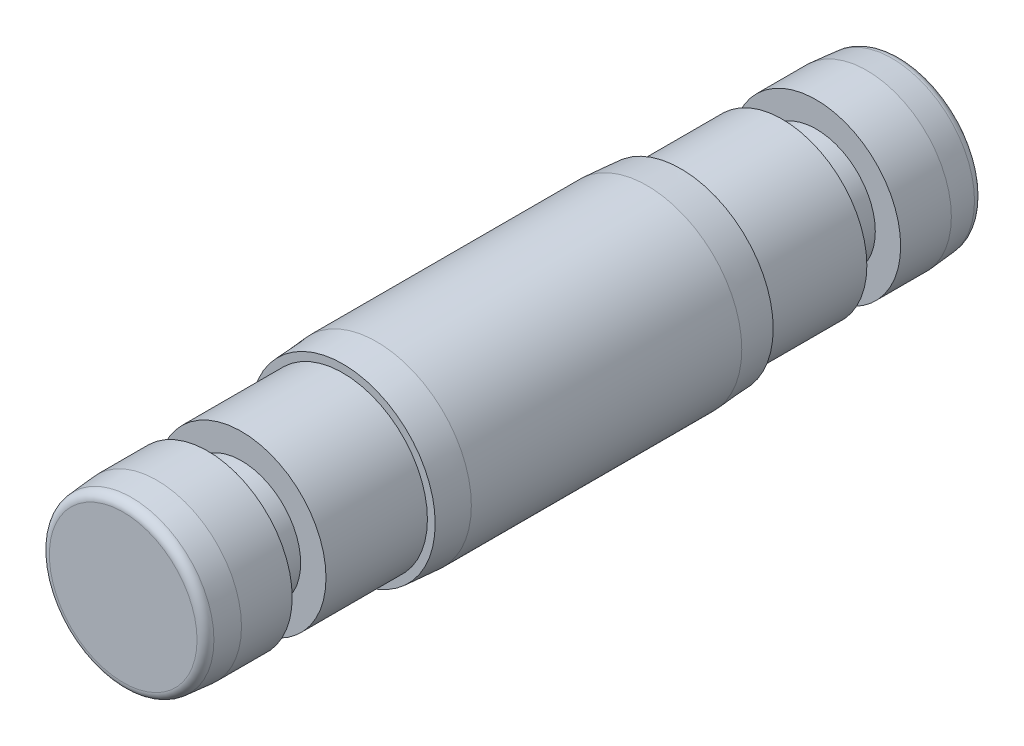
ISO-10303-21;
HEADER;
FILE_DESCRIPTION(('STEP AP214'),'2;1');
FILE_NAME('part.step','',(''),(''),'','','');
FILE_SCHEMA(('AUTOMOTIVE_DESIGN { 1 0 10303 214 1 1 1 1 }'));
ENDSEC;
DATA;
#1=APPLICATION_CONTEXT('core data for automotive mechanical design processes');
#2=APPLICATION_PROTOCOL_DEFINITION('international standard','automotive_design',2000,#1);
#3=PRODUCT_CONTEXT('',#1,'mechanical');
#4=PRODUCT('Part','Part','',(#3));
#5=PRODUCT_RELATED_PRODUCT_CATEGORY('part','',(#4));
#6=PRODUCT_DEFINITION_FORMATION('','',#4);
#7=PRODUCT_DEFINITION_CONTEXT('part definition',#1,'design');
#8=PRODUCT_DEFINITION('design','',#6,#7);
#9=PRODUCT_DEFINITION_SHAPE('','',#8);
#10=(LENGTH_UNIT() NAMED_UNIT(*) SI_UNIT(.MILLI.,.METRE.));
#11=(NAMED_UNIT(*) PLANE_ANGLE_UNIT() SI_UNIT($,.RADIAN.));
#12=(NAMED_UNIT(*) SI_UNIT($,.STERADIAN.) SOLID_ANGLE_UNIT());
#13=UNCERTAINTY_MEASURE_WITH_UNIT(LENGTH_MEASURE(1.E-05),#10,'distance_accuracy_value','');
#14=(GEOMETRIC_REPRESENTATION_CONTEXT(3) GLOBAL_UNCERTAINTY_ASSIGNED_CONTEXT((#13)) GLOBAL_UNIT_ASSIGNED_CONTEXT((#10,
#11,#12)) REPRESENTATION_CONTEXT('',''));
#15=CARTESIAN_POINT('',(0.,0.,0.));
#16=DIRECTION('',(0.,0.,1.));
#17=DIRECTION('',(1.,0.,0.));
#18=AXIS2_PLACEMENT_3D('',#15,#16,#17);
#19=CARTESIAN_POINT('',(0.,0.,9.5));
#20=DIRECTION('',(0.,0.,1.));
#21=DIRECTION('',(1.,0.,0.));
#22=AXIS2_PLACEMENT_3D('',#19,#20,#21);
#23=TOROIDAL_SURFACE('',#22,4.36876700471112,0.5);
#24=CARTESIAN_POINT('',(0.,0.,10.));
#25=DIRECTION('',(0.,0.,1.));
#26=DIRECTION('',(1.,0.,0.));
#27=AXIS2_PLACEMENT_3D('',#24,#25,#26);
#28=CIRCLE('',#27,4.36876700471112);
#29=CARTESIAN_POINT('',(4.36876700471112,0.,10.));
#30=VERTEX_POINT('',#29);
#31=EDGE_CURVE('E10',#30,#30,#28,.T.);
#32=ORIENTED_EDGE('',*,*,#31,.F.);
#33=EDGE_LOOP('',(#32));
#34=FACE_BOUND('',#33,.T.);
#35=CARTESIAN_POINT('',(0.,0.,9.5));
#36=DIRECTION('',(0.,0.,1.));
#37=DIRECTION('',(1.,0.,0.));
#38=AXIS2_PLACEMENT_3D('',#35,#36,#37);
#39=CIRCLE('',#38,4.86876700471112);
#40=CARTESIAN_POINT('',(4.86876700471112,0.,9.5));
#41=VERTEX_POINT('',#40);
#42=EDGE_CURVE('E65',#41,#41,#39,.T.);
#43=ORIENTED_EDGE('',*,*,#42,.T.);
#44=EDGE_LOOP('',(#43));
#45=FACE_BOUND('',#44,.T.);
#46=ADVANCED_FACE('F31',(#34,#45),#23,.T.);
#47=CARTESIAN_POINT('',(0.,4.36876700471112,10.));
#48=DIRECTION('',(0.,0.,-1.));
#49=DIRECTION('',(-1.,0.,0.));
#50=AXIS2_PLACEMENT_3D('',#47,#48,#49);
#51=PLANE('',#50);
#52=ORIENTED_EDGE('',*,*,#31,.T.);
#53=EDGE_LOOP('',(#52));
#54=FACE_BOUND('',#53,.T.);
#55=ADVANCED_FACE('F119',(#54),#51,.F.);
#56=CARTESIAN_POINT('',(0.,0.,3.));
#57=DIRECTION('',(0.,0.,1.));
#58=DIRECTION('',(1.,0.,0.));
#59=AXIS2_PLACEMENT_3D('',#56,#57,#58);
#60=CYLINDRICAL_SURFACE('',#59,5.6);
#61=CARTESIAN_POINT('',(0.,0.,-5.));
#62=DIRECTION('',(0.,0.,1.));
#63=DIRECTION('',(1.,0.,0.));
#64=AXIS2_PLACEMENT_3D('',#61,#62,#63);
#65=CIRCLE('',#64,5.6);
#66=CARTESIAN_POINT('',(5.6,0.,-5.));
#67=VERTEX_POINT('',#66);
#68=EDGE_CURVE('E37',#67,#67,#65,.T.);
#69=ORIENTED_EDGE('',*,*,#68,.F.);
#70=EDGE_LOOP('',(#69));
#71=FACE_BOUND('',#70,.T.);
#72=CARTESIAN_POINT('',(0.,0.,-21.));
#73=DIRECTION('',(0.,0.,1.));
#74=DIRECTION('',(1.,0.,0.));
#75=AXIS2_PLACEMENT_3D('',#72,#73,#74);
#76=CIRCLE('',#75,5.6);
#77=CARTESIAN_POINT('',(5.6,0.,-21.));
#78=VERTEX_POINT('',#77);
#79=EDGE_CURVE('E71',#78,#78,#76,.T.);
#80=ORIENTED_EDGE('',*,*,#79,.T.);
#81=EDGE_LOOP('',(#80));
#82=FACE_BOUND('',#81,.T.);
#83=ADVANCED_FACE('F124',(#71,#82),#60,.T.);
#84=CARTESIAN_POINT('',(0.,0.,-5.));
#85=DIRECTION('',(0.,0.,-1.));
#86=DIRECTION('',(-1.,0.,0.));
#87=AXIS2_PLACEMENT_3D('',#84,#85,#86);
#88=CONICAL_SURFACE('',#87,5.6,0.0698131700797735);
#89=CARTESIAN_POINT('',(0.,0.,-3.));
#90=DIRECTION('',(0.,0.,1.));
#91=DIRECTION('',(1.,0.,0.));
#92=AXIS2_PLACEMENT_3D('',#89,#90,#91);
#93=CIRCLE('',#92,5.46014637611298);
#94=CARTESIAN_POINT('',(5.46014637611298,0.,-3.));
#95=VERTEX_POINT('',#94);
#96=EDGE_CURVE('E41',#95,#95,#93,.T.);
#97=ORIENTED_EDGE('',*,*,#96,.F.);
#98=EDGE_LOOP('',(#97));
#99=FACE_BOUND('',#98,.T.);
#100=ORIENTED_EDGE('',*,*,#68,.T.);
#101=EDGE_LOOP('',(#100));
#102=FACE_BOUND('',#101,.T.);
#103=ADVANCED_FACE('F162',(#99,#102),#88,.T.);
#104=CARTESIAN_POINT('',(0.,5.,-3.));
#105=DIRECTION('',(0.,0.,-1.));
#106=DIRECTION('',(-1.,0.,0.));
#107=AXIS2_PLACEMENT_3D('',#104,#105,#106);
#108=PLANE('',#107);
#109=CARTESIAN_POINT('',(0.,0.,-3.));
#110=DIRECTION('',(0.,0.,1.));
#111=DIRECTION('',(1.,0.,0.));
#112=AXIS2_PLACEMENT_3D('',#109,#110,#111);
#113=CIRCLE('',#112,5.);
#114=CARTESIAN_POINT('',(5.,0.,-3.));
#115=VERTEX_POINT('',#114);
#116=EDGE_CURVE('E45',#115,#115,#113,.T.);
#117=ORIENTED_EDGE('',*,*,#116,.F.);
#118=EDGE_LOOP('',(#117));
#119=FACE_BOUND('',#118,.T.);
#120=ORIENTED_EDGE('',*,*,#96,.T.);
#121=EDGE_LOOP('',(#120));
#122=FACE_BOUND('',#121,.T.);
#123=ADVANCED_FACE('F156',(#119,#122),#108,.F.);
#124=CARTESIAN_POINT('',(0.,0.,3.));
#125=DIRECTION('',(0.,0.,1.));
#126=DIRECTION('',(1.,0.,0.));
#127=AXIS2_PLACEMENT_3D('',#124,#125,#126);
#128=CYLINDRICAL_SURFACE('',#127,5.);
#129=CARTESIAN_POINT('',(0.,0.,3.));
#130=DIRECTION('',(0.,0.,1.));
#131=DIRECTION('',(1.,0.,0.));
#132=AXIS2_PLACEMENT_3D('',#129,#130,#131);
#133=CIRCLE('',#132,5.);
#134=CARTESIAN_POINT('',(5.,0.,3.));
#135=VERTEX_POINT('',#134);
#136=EDGE_CURVE('E50',#135,#135,#133,.T.);
#137=ORIENTED_EDGE('',*,*,#136,.F.);
#138=EDGE_LOOP('',(#137));
#139=FACE_BOUND('',#138,.T.);
#140=ORIENTED_EDGE('',*,*,#116,.T.);
#141=EDGE_LOOP('',(#140));
#142=FACE_BOUND('',#141,.T.);
#143=ADVANCED_FACE('F150',(#139,#142),#128,.T.);
#144=CARTESIAN_POINT('',(0.,3.5,3.));
#145=DIRECTION('',(0.,0.,-1.));
#146=DIRECTION('',(-1.,0.,0.));
#147=AXIS2_PLACEMENT_3D('',#144,#145,#146);
#148=PLANE('',#147);
#149=CARTESIAN_POINT('',(0.,0.,3.));
#150=DIRECTION('',(0.,0.,1.));
#151=DIRECTION('',(1.,0.,0.));
#152=AXIS2_PLACEMENT_3D('',#149,#150,#151);
#153=CIRCLE('',#152,3.5);
#154=CARTESIAN_POINT('',(3.5,0.,3.));
#155=VERTEX_POINT('',#154);
#156=EDGE_CURVE('E53',#155,#155,#153,.T.);
#157=ORIENTED_EDGE('',*,*,#156,.F.);
#158=EDGE_LOOP('',(#157));
#159=FACE_BOUND('',#158,.T.);
#160=ORIENTED_EDGE('',*,*,#136,.T.);
#161=EDGE_LOOP('',(#160));
#162=FACE_BOUND('',#161,.T.);
#163=ADVANCED_FACE('F144',(#159,#162),#148,.F.);
#164=CARTESIAN_POINT('',(0.,0.,3.));
#165=DIRECTION('',(0.,0.,1.));
#166=DIRECTION('',(1.,0.,0.));
#167=AXIS2_PLACEMENT_3D('',#164,#165,#166);
#168=CYLINDRICAL_SURFACE('',#167,3.5);
#169=CARTESIAN_POINT('',(0.,0.,5.));
#170=DIRECTION('',(0.,0.,1.));
#171=DIRECTION('',(1.,0.,0.));
#172=AXIS2_PLACEMENT_3D('',#169,#170,#171);
#173=CIRCLE('',#172,3.5);
#174=CARTESIAN_POINT('',(3.5,0.,5.));
#175=VERTEX_POINT('',#174);
#176=EDGE_CURVE('E56',#175,#175,#173,.T.);
#177=ORIENTED_EDGE('',*,*,#176,.F.);
#178=EDGE_LOOP('',(#177));
#179=FACE_BOUND('',#178,.T.);
#180=ORIENTED_EDGE('',*,*,#156,.T.);
#181=EDGE_LOOP('',(#180));
#182=FACE_BOUND('',#181,.T.);
#183=ADVANCED_FACE('F138',(#179,#182),#168,.T.);
#184=CARTESIAN_POINT('',(0.,3.5,5.));
#185=DIRECTION('',(0.,0.,1.));
#186=DIRECTION('',(1.,0.,0.));
#187=AXIS2_PLACEMENT_3D('',#184,#185,#186);
#188=PLANE('',#187);
#189=CARTESIAN_POINT('',(0.,0.,5.));
#190=DIRECTION('',(0.,0.,1.));
#191=DIRECTION('',(1.,0.,0.));
#192=AXIS2_PLACEMENT_3D('',#189,#190,#191);
#193=CIRCLE('',#192,5.);
#194=CARTESIAN_POINT('',(5.,0.,5.));
#195=VERTEX_POINT('',#194);
#196=EDGE_CURVE('E59',#195,#195,#193,.T.);
#197=ORIENTED_EDGE('',*,*,#196,.F.);
#198=EDGE_LOOP('',(#197));
#199=FACE_BOUND('',#198,.T.);
#200=ORIENTED_EDGE('',*,*,#176,.T.);
#201=EDGE_LOOP('',(#200));
#202=FACE_BOUND('',#201,.T.);
#203=ADVANCED_FACE('F132',(#199,#202),#188,.F.);
#204=CARTESIAN_POINT('',(0.,0.,3.));
#205=DIRECTION('',(0.,0.,1.));
#206=DIRECTION('',(1.,0.,0.));
#207=AXIS2_PLACEMENT_3D('',#204,#205,#206);
#208=CYLINDRICAL_SURFACE('',#207,5.);
#209=CARTESIAN_POINT('',(0.,0.,8.));
#210=DIRECTION('',(0.,0.,1.));
#211=DIRECTION('',(1.,0.,0.));
#212=AXIS2_PLACEMENT_3D('',#209,#210,#211);
#213=CIRCLE('',#212,5.);
#214=CARTESIAN_POINT('',(5.,0.,8.));
#215=VERTEX_POINT('',#214);
#216=EDGE_CURVE('E62',#215,#215,#213,.T.);
#217=ORIENTED_EDGE('',*,*,#216,.F.);
#218=EDGE_LOOP('',(#217));
#219=FACE_BOUND('',#218,.T.);
#220=ORIENTED_EDGE('',*,*,#196,.T.);
#221=EDGE_LOOP('',(#220));
#222=FACE_BOUND('',#221,.T.);
#223=ADVANCED_FACE('F115',(#219,#222),#208,.T.);
#224=CARTESIAN_POINT('',(0.,0.,8.));
#225=DIRECTION('',(0.,0.,-1.));
#226=DIRECTION('',(-1.,0.,0.));
#227=AXIS2_PLACEMENT_3D('',#224,#225,#226);
#228=CONICAL_SURFACE('',#227,5.,0.0872664625997092);
#229=ORIENTED_EDGE('',*,*,#42,.F.);
#230=EDGE_LOOP('',(#229));
#231=FACE_BOUND('',#230,.T.);
#232=ORIENTED_EDGE('',*,*,#216,.T.);
#233=EDGE_LOOP('',(#232));
#234=FACE_BOUND('',#233,.T.);
#235=ADVANCED_FACE('F105',(#231,#234),#228,.T.);
#236=CARTESIAN_POINT('',(0.,0.,-35.5));
#237=DIRECTION('',(0.,0.,-1.));
#238=DIRECTION('',(1.,0.,0.));
#239=AXIS2_PLACEMENT_3D('',#236,#237,#238);
#240=TOROIDAL_SURFACE('',#239,4.36876700471112,0.5);
#241=CARTESIAN_POINT('',(0.,0.,-36.));
#242=DIRECTION('',(0.,0.,1.));
#243=DIRECTION('',(1.,0.,0.));
#244=AXIS2_PLACEMENT_3D('',#241,#242,#243);
#245=CIRCLE('',#244,4.36876700471112);
#246=CARTESIAN_POINT('',(4.36876700471112,0.,-36.));
#247=VERTEX_POINT('',#246);
#248=EDGE_CURVE('E68',#247,#247,#245,.T.);
#249=ORIENTED_EDGE('',*,*,#248,.T.);
#250=EDGE_LOOP('',(#249));
#251=FACE_BOUND('',#250,.T.);
#252=CARTESIAN_POINT('',(0.,0.,-35.5));
#253=DIRECTION('',(0.,0.,1.));
#254=DIRECTION('',(1.,0.,0.));
#255=AXIS2_PLACEMENT_3D('',#252,#253,#254);
#256=CIRCLE('',#255,4.86876700471112);
#257=CARTESIAN_POINT('',(4.86876700471112,0.,-35.5));
#258=VERTEX_POINT('',#257);
#259=EDGE_CURVE('E95',#258,#258,#256,.T.);
#260=ORIENTED_EDGE('',*,*,#259,.F.);
#261=EDGE_LOOP('',(#260));
#262=FACE_BOUND('',#261,.T.);
#263=ADVANCED_FACE('F102',(#251,#262),#240,.T.);
#264=CARTESIAN_POINT('',(0.,4.36876700471112,-36.));
#265=DIRECTION('',(0.,0.,1.));
#266=DIRECTION('',(-1.,0.,0.));
#267=AXIS2_PLACEMENT_3D('',#264,#265,#266);
#268=PLANE('',#267);
#269=ORIENTED_EDGE('',*,*,#248,.F.);
#270=EDGE_LOOP('',(#269));
#271=FACE_BOUND('',#270,.T.);
#272=ADVANCED_FACE('F104',(#271),#268,.F.);
#273=CARTESIAN_POINT('',(0.,0.,-21.));
#274=DIRECTION('',(0.,0.,1.));
#275=DIRECTION('',(-1.,0.,0.));
#276=AXIS2_PLACEMENT_3D('',#273,#274,#275);
#277=CONICAL_SURFACE('',#276,5.6,0.0698131700797735);
#278=CARTESIAN_POINT('',(0.,0.,-23.));
#279=DIRECTION('',(0.,0.,1.));
#280=DIRECTION('',(1.,0.,0.));
#281=AXIS2_PLACEMENT_3D('',#278,#279,#280);
#282=CIRCLE('',#281,5.46014637611298);
#283=CARTESIAN_POINT('',(5.46014637611298,0.,-23.));
#284=VERTEX_POINT('',#283);
#285=EDGE_CURVE('E74',#284,#284,#282,.T.);
#286=ORIENTED_EDGE('',*,*,#285,.T.);
#287=EDGE_LOOP('',(#286));
#288=FACE_BOUND('',#287,.T.);
#289=ORIENTED_EDGE('',*,*,#79,.F.);
#290=EDGE_LOOP('',(#289));
#291=FACE_BOUND('',#290,.T.);
#292=ADVANCED_FACE('F112',(#288,#291),#277,.T.);
#293=CARTESIAN_POINT('',(0.,5.,-23.));
#294=DIRECTION('',(0.,0.,1.));
#295=DIRECTION('',(-1.,0.,0.));
#296=AXIS2_PLACEMENT_3D('',#293,#294,#295);
#297=PLANE('',#296);
#298=CARTESIAN_POINT('',(0.,0.,-23.));
#299=DIRECTION('',(0.,0.,1.));
#300=DIRECTION('',(1.,0.,0.));
#301=AXIS2_PLACEMENT_3D('',#298,#299,#300);
#302=CIRCLE('',#301,5.);
#303=CARTESIAN_POINT('',(5.,0.,-23.));
#304=VERTEX_POINT('',#303);
#305=EDGE_CURVE('E77',#304,#304,#302,.T.);
#306=ORIENTED_EDGE('',*,*,#305,.T.);
#307=EDGE_LOOP('',(#306));
#308=FACE_BOUND('',#307,.T.);
#309=ORIENTED_EDGE('',*,*,#285,.F.);
#310=EDGE_LOOP('',(#309));
#311=FACE_BOUND('',#310,.T.);
#312=ADVANCED_FACE('F179',(#308,#311),#297,.F.);
#313=CARTESIAN_POINT('',(0.,0.,-29.));
#314=DIRECTION('',(0.,0.,-1.));
#315=DIRECTION('',(1.,0.,0.));
#316=AXIS2_PLACEMENT_3D('',#313,#314,#315);
#317=CYLINDRICAL_SURFACE('',#316,5.);
#318=CARTESIAN_POINT('',(0.,0.,-29.));
#319=DIRECTION('',(0.,0.,1.));
#320=DIRECTION('',(1.,0.,0.));
#321=AXIS2_PLACEMENT_3D('',#318,#319,#320);
#322=CIRCLE('',#321,5.);
#323=CARTESIAN_POINT('',(5.,0.,-29.));
#324=VERTEX_POINT('',#323);
#325=EDGE_CURVE('E80',#324,#324,#322,.T.);
#326=ORIENTED_EDGE('',*,*,#325,.T.);
#327=EDGE_LOOP('',(#326));
#328=FACE_BOUND('',#327,.T.);
#329=ORIENTED_EDGE('',*,*,#305,.F.);
#330=EDGE_LOOP('',(#329));
#331=FACE_BOUND('',#330,.T.);
#332=ADVANCED_FACE('F185',(#328,#331),#317,.T.);
#333=CARTESIAN_POINT('',(0.,3.5,-29.));
#334=DIRECTION('',(0.,0.,1.));
#335=DIRECTION('',(-1.,0.,0.));
#336=AXIS2_PLACEMENT_3D('',#333,#334,#335);
#337=PLANE('',#336);
#338=CARTESIAN_POINT('',(0.,0.,-29.));
#339=DIRECTION('',(0.,0.,1.));
#340=DIRECTION('',(1.,0.,0.));
#341=AXIS2_PLACEMENT_3D('',#338,#339,#340);
#342=CIRCLE('',#341,3.5);
#343=CARTESIAN_POINT('',(3.5,0.,-29.));
#344=VERTEX_POINT('',#343);
#345=EDGE_CURVE('E83',#344,#344,#342,.T.);
#346=ORIENTED_EDGE('',*,*,#345,.T.);
#347=EDGE_LOOP('',(#346));
#348=FACE_BOUND('',#347,.T.);
#349=ORIENTED_EDGE('',*,*,#325,.F.);
#350=EDGE_LOOP('',(#349));
#351=FACE_BOUND('',#350,.T.);
#352=ADVANCED_FACE('F191',(#348,#351),#337,.F.);
#353=CARTESIAN_POINT('',(0.,0.,-29.));
#354=DIRECTION('',(0.,0.,-1.));
#355=DIRECTION('',(1.,0.,0.));
#356=AXIS2_PLACEMENT_3D('',#353,#354,#355);
#357=CYLINDRICAL_SURFACE('',#356,3.5);
#358=CARTESIAN_POINT('',(0.,0.,-31.));
#359=DIRECTION('',(0.,0.,1.));
#360=DIRECTION('',(1.,0.,0.));
#361=AXIS2_PLACEMENT_3D('',#358,#359,#360);
#362=CIRCLE('',#361,3.5);
#363=CARTESIAN_POINT('',(3.5,0.,-31.));
#364=VERTEX_POINT('',#363);
#365=EDGE_CURVE('E86',#364,#364,#362,.T.);
#366=ORIENTED_EDGE('',*,*,#365,.T.);
#367=EDGE_LOOP('',(#366));
#368=FACE_BOUND('',#367,.T.);
#369=ORIENTED_EDGE('',*,*,#345,.F.);
#370=EDGE_LOOP('',(#369));
#371=FACE_BOUND('',#370,.T.);
#372=ADVANCED_FACE('F195',(#368,#371),#357,.T.);
#373=CARTESIAN_POINT('',(0.,3.5,-31.));
#374=DIRECTION('',(0.,0.,-1.));
#375=DIRECTION('',(1.,0.,0.));
#376=AXIS2_PLACEMENT_3D('',#373,#374,#375);
#377=PLANE('',#376);
#378=CARTESIAN_POINT('',(0.,0.,-31.));
#379=DIRECTION('',(0.,0.,1.));
#380=DIRECTION('',(1.,0.,0.));
#381=AXIS2_PLACEMENT_3D('',#378,#379,#380);
#382=CIRCLE('',#381,5.);
#383=CARTESIAN_POINT('',(5.,0.,-31.));
#384=VERTEX_POINT('',#383);
#385=EDGE_CURVE('E89',#384,#384,#382,.T.);
#386=ORIENTED_EDGE('',*,*,#385,.T.);
#387=EDGE_LOOP('',(#386));
#388=FACE_BOUND('',#387,.T.);
#389=ORIENTED_EDGE('',*,*,#365,.F.);
#390=EDGE_LOOP('',(#389));
#391=FACE_BOUND('',#390,.T.);
#392=ADVANCED_FACE('F199',(#388,#391),#377,.F.);
#393=CARTESIAN_POINT('',(0.,0.,-29.));
#394=DIRECTION('',(0.,0.,-1.));
#395=DIRECTION('',(1.,0.,0.));
#396=AXIS2_PLACEMENT_3D('',#393,#394,#395);
#397=CYLINDRICAL_SURFACE('',#396,5.);
#398=CARTESIAN_POINT('',(0.,0.,-34.));
#399=DIRECTION('',(0.,0.,1.));
#400=DIRECTION('',(1.,0.,0.));
#401=AXIS2_PLACEMENT_3D('',#398,#399,#400);
#402=CIRCLE('',#401,5.);
#403=CARTESIAN_POINT('',(5.,0.,-34.));
#404=VERTEX_POINT('',#403);
#405=EDGE_CURVE('E92',#404,#404,#402,.T.);
#406=ORIENTED_EDGE('',*,*,#405,.T.);
#407=EDGE_LOOP('',(#406));
#408=FACE_BOUND('',#407,.T.);
#409=ORIENTED_EDGE('',*,*,#385,.F.);
#410=EDGE_LOOP('',(#409));
#411=FACE_BOUND('',#410,.T.);
#412=ADVANCED_FACE('F203',(#408,#411),#397,.T.);
#413=CARTESIAN_POINT('',(0.,0.,-34.));
#414=DIRECTION('',(0.,0.,1.));
#415=DIRECTION('',(-1.,0.,0.));
#416=AXIS2_PLACEMENT_3D('',#413,#414,#415);
#417=CONICAL_SURFACE('',#416,5.,0.0872664625997092);
#418=ORIENTED_EDGE('',*,*,#259,.T.);
#419=EDGE_LOOP('',(#418));
#420=FACE_BOUND('',#419,.T.);
#421=ORIENTED_EDGE('',*,*,#405,.F.);
#422=EDGE_LOOP('',(#421));
#423=FACE_BOUND('',#422,.T.);
#424=ADVANCED_FACE('F99',(#420,#423),#417,.T.);
#425=CLOSED_SHELL('',(#46,#55,#83,#103,#123,#143,#163,#183,#203,#223,#235,#263,#272,#292,#312,
#332,#352,#372,#392,#412,#424));
#426=MANIFOLD_SOLID_BREP('B2',#425);
#427=ADVANCED_BREP_SHAPE_REPRESENTATION('',(#18,#426),#14);
#428=SHAPE_DEFINITION_REPRESENTATION(#9,#427);
ENDSEC;
END-ISO-10303-21;
